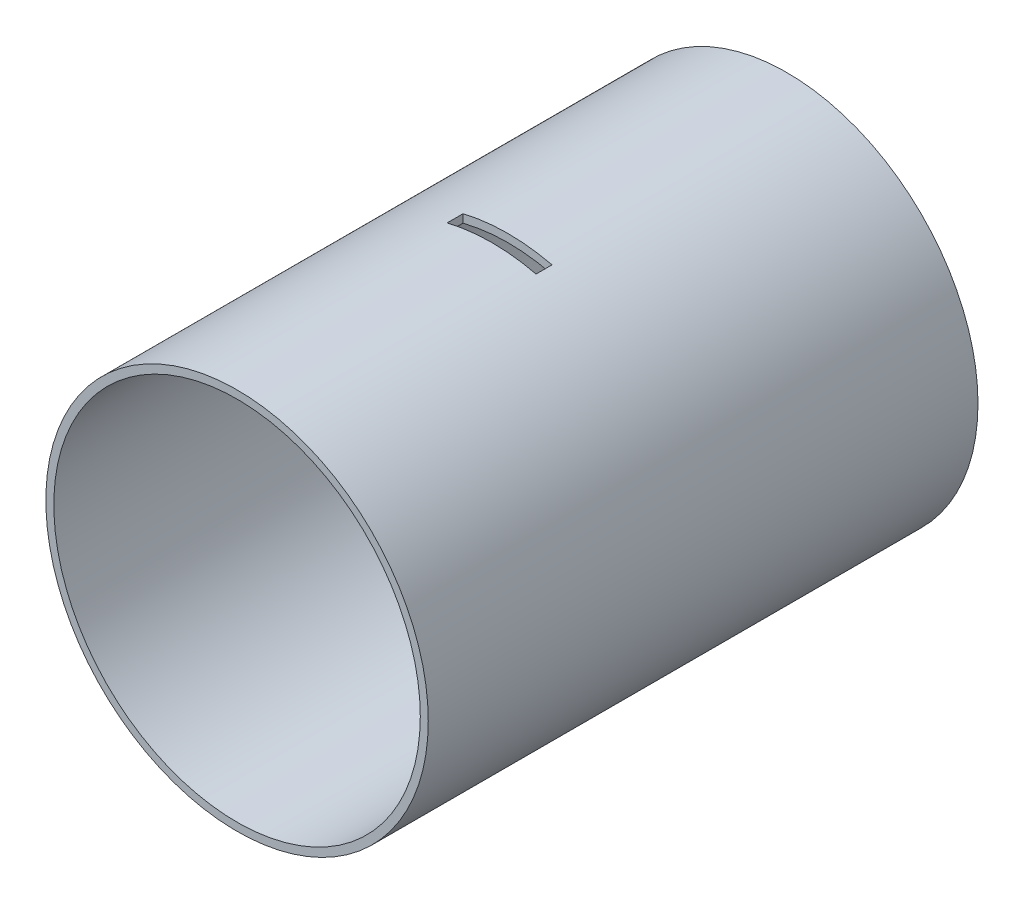
ISO-10303-21;
HEADER;
FILE_DESCRIPTION(('STEP AP214'),'2;1');
FILE_NAME('part.step','',(''),(''),'','','');
FILE_SCHEMA(('AUTOMOTIVE_DESIGN { 1 0 10303 214 1 1 1 1 }'));
ENDSEC;
DATA;
#1=APPLICATION_CONTEXT('core data for automotive mechanical design processes');
#2=APPLICATION_PROTOCOL_DEFINITION('international standard','automotive_design',2000,#1);
#3=PRODUCT_CONTEXT('',#1,'mechanical');
#4=PRODUCT('Part','Part','',(#3));
#5=PRODUCT_RELATED_PRODUCT_CATEGORY('part','',(#4));
#6=PRODUCT_DEFINITION_FORMATION('','',#4);
#7=PRODUCT_DEFINITION_CONTEXT('part definition',#1,'design');
#8=PRODUCT_DEFINITION('design','',#6,#7);
#9=PRODUCT_DEFINITION_SHAPE('','',#8);
#10=(LENGTH_UNIT() NAMED_UNIT(*) SI_UNIT(.MILLI.,.METRE.));
#11=(NAMED_UNIT(*) PLANE_ANGLE_UNIT() SI_UNIT($,.RADIAN.));
#12=(NAMED_UNIT(*) SI_UNIT($,.STERADIAN.) SOLID_ANGLE_UNIT());
#13=UNCERTAINTY_MEASURE_WITH_UNIT(LENGTH_MEASURE(1.E-05),#10,'distance_accuracy_value','');
#14=(GEOMETRIC_REPRESENTATION_CONTEXT(3) GLOBAL_UNCERTAINTY_ASSIGNED_CONTEXT((#13)) GLOBAL_UNIT_ASSIGNED_CONTEXT((#10,
#11,#12)) REPRESENTATION_CONTEXT('',''));
#15=CARTESIAN_POINT('',(0.,0.,0.));
#16=DIRECTION('',(0.,0.,1.));
#17=DIRECTION('',(1.,0.,0.));
#18=AXIS2_PLACEMENT_3D('',#15,#16,#17);
#19=CARTESIAN_POINT('',(0.,0.,438.15));
#20=DIRECTION('',(0.,0.,1.));
#21=DIRECTION('',(1.,0.,0.));
#22=AXIS2_PLACEMENT_3D('',#19,#20,#21);
#23=PLANE('',#22);
#24=CARTESIAN_POINT('',(0.,0.,438.15));
#25=DIRECTION('',(0.,0.,1.));
#26=DIRECTION('',(1.,0.,0.));
#27=AXIS2_PLACEMENT_3D('',#24,#25,#26);
#28=CIRCLE('',#27,152.4);
#29=CARTESIAN_POINT('',(152.4,0.,438.15));
#30=VERTEX_POINT('',#29);
#31=EDGE_CURVE('E187',#30,#30,#28,.T.);
#32=ORIENTED_EDGE('',*,*,#31,.T.);
#33=EDGE_LOOP('',(#32));
#34=FACE_BOUND('',#33,.T.);
#35=CARTESIAN_POINT('',(0.,0.,438.15));
#36=DIRECTION('',(0.,0.,1.));
#37=DIRECTION('',(1.,0.,0.));
#38=AXIS2_PLACEMENT_3D('',#35,#36,#37);
#39=CIRCLE('',#38,146.05);
#40=CARTESIAN_POINT('',(146.05,0.,438.15));
#41=VERTEX_POINT('',#40);
#42=EDGE_CURVE('E180',#41,#41,#39,.T.);
#43=ORIENTED_EDGE('',*,*,#42,.F.);
#44=EDGE_LOOP('',(#43));
#45=FACE_BOUND('',#44,.T.);
#46=ADVANCED_FACE('F37',(#34,#45),#23,.T.);
#47=CARTESIAN_POINT('',(0.,0.,0.));
#48=DIRECTION('',(0.,0.,1.));
#49=DIRECTION('',(1.,0.,0.));
#50=AXIS2_PLACEMENT_3D('',#47,#48,#49);
#51=PLANE('',#50);
#52=CARTESIAN_POINT('',(0.,0.,0.));
#53=DIRECTION('',(0.,0.,1.));
#54=DIRECTION('',(1.,0.,0.));
#55=AXIS2_PLACEMENT_3D('',#52,#53,#54);
#56=CIRCLE('',#55,152.4);
#57=CARTESIAN_POINT('',(152.4,0.,0.));
#58=VERTEX_POINT('',#57);
#59=EDGE_CURVE('E183',#58,#58,#56,.T.);
#60=ORIENTED_EDGE('',*,*,#59,.F.);
#61=EDGE_LOOP('',(#60));
#62=FACE_BOUND('',#61,.T.);
#63=CARTESIAN_POINT('',(0.,0.,0.));
#64=DIRECTION('',(0.,0.,1.));
#65=DIRECTION('',(1.,0.,0.));
#66=AXIS2_PLACEMENT_3D('',#63,#64,#65);
#67=CIRCLE('',#66,146.05);
#68=CARTESIAN_POINT('',(146.05,0.,0.));
#69=VERTEX_POINT('',#68);
#70=EDGE_CURVE('E184',#69,#69,#67,.T.);
#71=ORIENTED_EDGE('',*,*,#70,.T.);
#72=EDGE_LOOP('',(#71));
#73=FACE_BOUND('',#72,.T.);
#74=ADVANCED_FACE('F234',(#62,#73),#51,.F.);
#75=CARTESIAN_POINT('',(0.,0.,438.15));
#76=DIRECTION('',(0.,0.,-1.));
#77=DIRECTION('',(-1.,0.,0.));
#78=AXIS2_PLACEMENT_3D('',#75,#76,#77);
#79=CYLINDRICAL_SURFACE('',#78,152.4);
#80=DIRECTION('',(0.,0.,-1.));
#81=VECTOR('',#80,1.);
#82=CARTESIAN_POINT('',(-151.868936771718,-12.7116499254766,438.15));
#83=LINE('',#82,#81);
#84=CARTESIAN_POINT('',(-151.868936771718,-12.7116499254766,234.95));
#85=VERTEX_POINT('',#84);
#86=CARTESIAN_POINT('',(-151.868936771718,-12.7116499254766,222.25));
#87=VERTEX_POINT('',#86);
#88=EDGE_CURVE('E140',#85,#87,#83,.T.);
#89=ORIENTED_EDGE('',*,*,#88,.T.);
#90=CARTESIAN_POINT('',(0.,0.,222.25));
#91=DIRECTION('',(0.,0.,-1.));
#92=DIRECTION('',(-1.,0.,0.));
#93=AXIS2_PLACEMENT_3D('',#90,#91,#92);
#94=CIRCLE('',#93,152.4);
#95=CARTESIAN_POINT('',(-151.868936771718,12.7116499254766,222.25));
#96=VERTEX_POINT('',#95);
#97=EDGE_CURVE('E133',#87,#96,#94,.T.);
#98=ORIENTED_EDGE('',*,*,#97,.T.);
#99=DIRECTION('',(0.,0.,-1.));
#100=VECTOR('',#99,1.);
#101=CARTESIAN_POINT('',(-151.868936771718,12.7116499254766,438.15));
#102=LINE('',#101,#100);
#103=CARTESIAN_POINT('',(-151.868936771718,12.7116499254766,234.95));
#104=VERTEX_POINT('',#103);
#105=EDGE_CURVE('E122',#96,#104,#102,.F.);
#106=ORIENTED_EDGE('',*,*,#105,.T.);
#107=CARTESIAN_POINT('',(0.,0.,234.95));
#108=DIRECTION('',(0.,0.,1.));
#109=DIRECTION('',(1.,0.,0.));
#110=AXIS2_PLACEMENT_3D('',#107,#108,#109);
#111=CIRCLE('',#110,152.4);
#112=EDGE_CURVE('E127',#104,#85,#111,.T.);
#113=ORIENTED_EDGE('',*,*,#112,.T.);
#114=EDGE_LOOP('',(#89,#98,#106,#113));
#115=FACE_BOUND('',#114,.T.);
#116=DIRECTION('',(0.,0.,-1.));
#117=VECTOR('',#116,1.);
#118=CARTESIAN_POINT('',(-35.779138521729,-148.140518585034,438.15));
#119=LINE('',#118,#117);
#120=CARTESIAN_POINT('',(-35.779138521729,-148.140518585034,222.25));
#121=VERTEX_POINT('',#120);
#122=CARTESIAN_POINT('',(-35.779138521729,-148.140518585035,234.95));
#123=VERTEX_POINT('',#122);
#124=EDGE_CURVE('E170',#121,#123,#119,.F.);
#125=ORIENTED_EDGE('',*,*,#124,.T.);
#126=CARTESIAN_POINT('',(0.,0.,234.95));
#127=DIRECTION('',(0.,0.,1.));
#128=DIRECTION('',(1.,0.,0.));
#129=AXIS2_PLACEMENT_3D('',#126,#127,#128);
#130=CIRCLE('',#129,152.4);
#131=CARTESIAN_POINT('',(35.1399245109825,-148.293444579868,234.95));
#132=VERTEX_POINT('',#131);
#133=EDGE_CURVE('E176',#123,#132,#130,.T.);
#134=ORIENTED_EDGE('',*,*,#133,.T.);
#135=DIRECTION('',(0.,0.,-1.));
#136=VECTOR('',#135,1.);
#137=CARTESIAN_POINT('',(35.1399245109825,-148.293444579868,438.15));
#138=LINE('',#137,#136);
#139=CARTESIAN_POINT('',(35.1399245109825,-148.293444579868,222.25));
#140=VERTEX_POINT('',#139);
#141=EDGE_CURVE('E163',#132,#140,#138,.T.);
#142=ORIENTED_EDGE('',*,*,#141,.T.);
#143=CARTESIAN_POINT('',(0.,0.,222.25));
#144=DIRECTION('',(0.,0.,1.));
#145=DIRECTION('',(1.,0.,0.));
#146=AXIS2_PLACEMENT_3D('',#143,#144,#145);
#147=CIRCLE('',#146,152.4);
#148=EDGE_CURVE('E166',#121,#140,#147,.T.);
#149=ORIENTED_EDGE('',*,*,#148,.F.);
#150=EDGE_LOOP('',(#125,#134,#142,#149));
#151=FACE_BOUND('',#150,.T.);
#152=DIRECTION('',(0.,0.,-1.));
#153=VECTOR('',#152,1.);
#154=CARTESIAN_POINT('',(35.1399245109825,148.293444579868,438.15));
#155=LINE('',#154,#153);
#156=CARTESIAN_POINT('',(35.1399245109825,148.293444579868,222.25));
#157=VERTEX_POINT('',#156);
#158=CARTESIAN_POINT('',(35.1399245109825,148.293444579868,234.95));
#159=VERTEX_POINT('',#158);
#160=EDGE_CURVE('E160',#157,#159,#155,.F.);
#161=ORIENTED_EDGE('',*,*,#160,.T.);
#162=CARTESIAN_POINT('',(-35.779138521729,148.140518585034,234.95));
#163=VERTEX_POINT('',#162);
#164=EDGE_CURVE('E179',#159,#163,#130,.T.);
#165=ORIENTED_EDGE('',*,*,#164,.T.);
#166=DIRECTION('',(0.,0.,-1.));
#167=VECTOR('',#166,1.);
#168=CARTESIAN_POINT('',(-35.779138521729,148.140518585034,438.15));
#169=LINE('',#168,#167);
#170=CARTESIAN_POINT('',(-35.779138521729,148.140518585034,222.25));
#171=VERTEX_POINT('',#170);
#172=EDGE_CURVE('E173',#163,#171,#169,.T.);
#173=ORIENTED_EDGE('',*,*,#172,.T.);
#174=EDGE_CURVE('E169',#157,#171,#147,.T.);
#175=ORIENTED_EDGE('',*,*,#174,.F.);
#176=EDGE_LOOP('',(#161,#165,#173,#175));
#177=FACE_BOUND('',#176,.T.);
#178=ORIENTED_EDGE('',*,*,#31,.F.);
#179=EDGE_LOOP('',(#178));
#180=FACE_BOUND('',#179,.T.);
#181=ORIENTED_EDGE('',*,*,#59,.T.);
#182=EDGE_LOOP('',(#181));
#183=FACE_BOUND('',#182,.T.);
#184=ADVANCED_FACE('F39',(#115,#151,#177,#180,#183),#79,.T.);
#185=CARTESIAN_POINT('',(0.,0.,438.15));
#186=DIRECTION('',(0.,0.,-1.));
#187=DIRECTION('',(-1.,0.,0.));
#188=AXIS2_PLACEMENT_3D('',#185,#186,#187);
#189=CYLINDRICAL_SURFACE('',#188,146.05);
#190=CARTESIAN_POINT('',(0.,0.,222.25));
#191=DIRECTION('',(0.,0.,-1.));
#192=DIRECTION('',(-1.,0.,0.));
#193=AXIS2_PLACEMENT_3D('',#190,#191,#192);
#194=CIRCLE('',#193,146.05);
#195=CARTESIAN_POINT('',(-145.495760956023,-12.7116499254766,222.25));
#196=VERTEX_POINT('',#195);
#197=CARTESIAN_POINT('',(-145.495760956023,12.7116499254766,222.25));
#198=VERTEX_POINT('',#197);
#199=EDGE_CURVE('E11',#196,#198,#194,.T.);
#200=ORIENTED_EDGE('',*,*,#199,.F.);
#201=DIRECTION('',(0.,0.,-1.));
#202=VECTOR('',#201,1.);
#203=CARTESIAN_POINT('',(-145.495760956023,-12.7116499254766,438.15));
#204=LINE('',#203,#202);
#205=CARTESIAN_POINT('',(-145.495760956023,-12.7116499254766,234.95));
#206=VERTEX_POINT('',#205);
#207=EDGE_CURVE('E45',#206,#196,#204,.T.);
#208=ORIENTED_EDGE('',*,*,#207,.F.);
#209=CARTESIAN_POINT('',(0.,0.,234.95));
#210=DIRECTION('',(0.,0.,1.));
#211=DIRECTION('',(1.,0.,0.));
#212=AXIS2_PLACEMENT_3D('',#209,#210,#211);
#213=CIRCLE('',#212,146.05);
#214=CARTESIAN_POINT('',(-145.495760956023,12.7116499254766,234.95));
#215=VERTEX_POINT('',#214);
#216=EDGE_CURVE('E209',#215,#206,#213,.T.);
#217=ORIENTED_EDGE('',*,*,#216,.F.);
#218=DIRECTION('',(0.,0.,-1.));
#219=VECTOR('',#218,1.);
#220=CARTESIAN_POINT('',(-145.495760956023,12.7116499254766,438.15));
#221=LINE('',#220,#219);
#222=EDGE_CURVE('E207',#198,#215,#221,.F.);
#223=ORIENTED_EDGE('',*,*,#222,.F.);
#224=EDGE_LOOP('',(#200,#208,#217,#223));
#225=FACE_BOUND('',#224,.T.);
#226=CARTESIAN_POINT('',(0.,0.,234.95));
#227=DIRECTION('',(0.,0.,1.));
#228=DIRECTION('',(1.,0.,0.));
#229=AXIS2_PLACEMENT_3D('',#226,#227,#228);
#230=CIRCLE('',#229,146.05);
#231=CARTESIAN_POINT('',(-35.779138521729,-141.599631873261,234.95));
#232=VERTEX_POINT('',#231);
#233=CARTESIAN_POINT('',(35.1399245109825,-141.759614154958,234.95));
#234=VERTEX_POINT('',#233);
#235=EDGE_CURVE('E203',#232,#234,#230,.T.);
#236=ORIENTED_EDGE('',*,*,#235,.F.);
#237=DIRECTION('',(0.,0.,-1.));
#238=VECTOR('',#237,1.);
#239=CARTESIAN_POINT('',(-35.779138521729,-141.599631873261,438.15));
#240=LINE('',#239,#238);
#241=CARTESIAN_POINT('',(-35.779138521729,-141.599631873261,222.25));
#242=VERTEX_POINT('',#241);
#243=EDGE_CURVE('E205',#242,#232,#240,.F.);
#244=ORIENTED_EDGE('',*,*,#243,.F.);
#245=CARTESIAN_POINT('',(0.,0.,222.25));
#246=DIRECTION('',(0.,0.,1.));
#247=DIRECTION('',(1.,0.,0.));
#248=AXIS2_PLACEMENT_3D('',#245,#246,#247);
#249=CIRCLE('',#248,146.05);
#250=CARTESIAN_POINT('',(35.1399245109825,-141.759614154958,222.25));
#251=VERTEX_POINT('',#250);
#252=EDGE_CURVE('E198',#242,#251,#249,.T.);
#253=ORIENTED_EDGE('',*,*,#252,.T.);
#254=DIRECTION('',(0.,0.,-1.));
#255=VECTOR('',#254,1.);
#256=CARTESIAN_POINT('',(35.1399245109825,-141.759614154958,438.15));
#257=LINE('',#256,#255);
#258=EDGE_CURVE('E202',#234,#251,#257,.T.);
#259=ORIENTED_EDGE('',*,*,#258,.F.);
#260=EDGE_LOOP('',(#236,#244,#253,#259));
#261=FACE_BOUND('',#260,.T.);
#262=CARTESIAN_POINT('',(35.1399245109825,141.759614154957,234.95));
#263=VERTEX_POINT('',#262);
#264=CARTESIAN_POINT('',(-35.779138521729,141.59963187326,234.95));
#265=VERTEX_POINT('',#264);
#266=EDGE_CURVE('E200',#263,#265,#230,.T.);
#267=ORIENTED_EDGE('',*,*,#266,.F.);
#268=DIRECTION('',(0.,0.,-1.));
#269=VECTOR('',#268,1.);
#270=CARTESIAN_POINT('',(35.1399245109825,141.759614154958,438.15));
#271=LINE('',#270,#269);
#272=CARTESIAN_POINT('',(35.1399245109825,141.759614154958,222.25));
#273=VERTEX_POINT('',#272);
#274=EDGE_CURVE('E190',#273,#263,#271,.F.);
#275=ORIENTED_EDGE('',*,*,#274,.F.);
#276=CARTESIAN_POINT('',(-35.779138521729,141.599631873261,222.25));
#277=VERTEX_POINT('',#276);
#278=EDGE_CURVE('E194',#273,#277,#249,.T.);
#279=ORIENTED_EDGE('',*,*,#278,.T.);
#280=DIRECTION('',(0.,0.,-1.));
#281=VECTOR('',#280,1.);
#282=CARTESIAN_POINT('',(-35.779138521729,141.599631873261,438.15));
#283=LINE('',#282,#281);
#284=EDGE_CURVE('E197',#265,#277,#283,.T.);
#285=ORIENTED_EDGE('',*,*,#284,.F.);
#286=EDGE_LOOP('',(#267,#275,#279,#285));
#287=FACE_BOUND('',#286,.T.);
#288=ORIENTED_EDGE('',*,*,#42,.T.);
#289=EDGE_LOOP('',(#288));
#290=FACE_BOUND('',#289,.T.);
#291=ORIENTED_EDGE('',*,*,#70,.F.);
#292=EDGE_LOOP('',(#291));
#293=FACE_BOUND('',#292,.T.);
#294=ADVANCED_FACE('F219',(#225,#261,#287,#290,#293),#189,.F.);
#295=CARTESIAN_POINT('',(35.1399245109825,-400.05,0.));
#296=DIRECTION('',(1.,0.,0.));
#297=DIRECTION('',(0.,0.,-1.));
#298=AXIS2_PLACEMENT_3D('',#295,#296,#297);
#299=PLANE('',#298);
#300=DIRECTION('',(0.,1.,0.));
#301=VECTOR('',#300,1.);
#302=CARTESIAN_POINT('',(35.1399245109825,-400.05,222.25));
#303=LINE('',#302,#301);
#304=EDGE_CURVE('E157',#273,#157,#303,.T.);
#305=ORIENTED_EDGE('',*,*,#304,.F.);
#306=ORIENTED_EDGE('',*,*,#274,.T.);
#307=DIRECTION('',(0.,1.,0.));
#308=VECTOR('',#307,1.);
#309=CARTESIAN_POINT('',(35.1399245109825,-400.05,234.95));
#310=LINE('',#309,#308);
#311=EDGE_CURVE('E141',#263,#159,#310,.T.);
#312=ORIENTED_EDGE('',*,*,#311,.T.);
#313=ORIENTED_EDGE('',*,*,#160,.F.);
#314=EDGE_LOOP('',(#305,#306,#312,#313));
#315=FACE_BOUND('',#314,.T.);
#316=ADVANCED_FACE('F245',(#315),#299,.F.);
#317=CARTESIAN_POINT('',(0.,-400.05,222.25));
#318=DIRECTION('',(0.,0.,1.));
#319=DIRECTION('',(1.,0.,0.));
#320=AXIS2_PLACEMENT_3D('',#317,#318,#319);
#321=PLANE('',#320);
#322=ORIENTED_EDGE('',*,*,#174,.T.);
#323=DIRECTION('',(0.,1.,0.));
#324=VECTOR('',#323,1.);
#325=CARTESIAN_POINT('',(-35.779138521729,-400.05,222.25));
#326=LINE('',#325,#324);
#327=EDGE_CURVE('E153',#277,#171,#326,.T.);
#328=ORIENTED_EDGE('',*,*,#327,.F.);
#329=ORIENTED_EDGE('',*,*,#278,.F.);
#330=ORIENTED_EDGE('',*,*,#304,.T.);
#331=EDGE_LOOP('',(#322,#328,#329,#330));
#332=FACE_BOUND('',#331,.T.);
#333=ADVANCED_FACE('F257',(#332),#321,.T.);
#334=CARTESIAN_POINT('',(-35.779138521729,-400.05,0.));
#335=DIRECTION('',(-1.,0.,0.));
#336=DIRECTION('',(0.,0.,1.));
#337=AXIS2_PLACEMENT_3D('',#334,#335,#336);
#338=PLANE('',#337);
#339=DIRECTION('',(0.,1.,0.));
#340=VECTOR('',#339,1.);
#341=CARTESIAN_POINT('',(-35.779138521729,-400.05,234.95));
#342=LINE('',#341,#340);
#343=EDGE_CURVE('E148',#265,#163,#342,.T.);
#344=ORIENTED_EDGE('',*,*,#343,.F.);
#345=ORIENTED_EDGE('',*,*,#284,.T.);
#346=ORIENTED_EDGE('',*,*,#327,.T.);
#347=ORIENTED_EDGE('',*,*,#172,.F.);
#348=EDGE_LOOP('',(#344,#345,#346,#347));
#349=FACE_BOUND('',#348,.T.);
#350=ADVANCED_FACE('F250',(#349),#338,.F.);
#351=CARTESIAN_POINT('',(0.,-400.05,234.95));
#352=DIRECTION('',(0.,0.,1.));
#353=DIRECTION('',(1.,0.,0.));
#354=AXIS2_PLACEMENT_3D('',#351,#352,#353);
#355=PLANE('',#354);
#356=ORIENTED_EDGE('',*,*,#311,.F.);
#357=ORIENTED_EDGE('',*,*,#266,.T.);
#358=ORIENTED_EDGE('',*,*,#343,.T.);
#359=ORIENTED_EDGE('',*,*,#164,.F.);
#360=EDGE_LOOP('',(#356,#357,#358,#359));
#361=FACE_BOUND('',#360,.T.);
#362=ADVANCED_FACE('F246',(#361),#355,.F.);
#363=EDGE_CURVE('E151',#123,#232,#342,.T.);
#364=ORIENTED_EDGE('',*,*,#363,.T.);
#365=ORIENTED_EDGE('',*,*,#235,.T.);
#366=EDGE_CURVE('E143',#132,#234,#310,.T.);
#367=ORIENTED_EDGE('',*,*,#366,.F.);
#368=ORIENTED_EDGE('',*,*,#133,.F.);
#369=EDGE_LOOP('',(#364,#365,#367,#368));
#370=FACE_BOUND('',#369,.T.);
#371=ADVANCED_FACE('F249',(#370),#355,.F.);
#372=EDGE_CURVE('E152',#121,#242,#326,.T.);
#373=ORIENTED_EDGE('',*,*,#372,.T.);
#374=ORIENTED_EDGE('',*,*,#243,.T.);
#375=ORIENTED_EDGE('',*,*,#363,.F.);
#376=ORIENTED_EDGE('',*,*,#124,.F.);
#377=EDGE_LOOP('',(#373,#374,#375,#376));
#378=FACE_BOUND('',#377,.T.);
#379=ADVANCED_FACE('F264',(#378),#338,.F.);
#380=ORIENTED_EDGE('',*,*,#148,.T.);
#381=EDGE_CURVE('E156',#140,#251,#303,.T.);
#382=ORIENTED_EDGE('',*,*,#381,.T.);
#383=ORIENTED_EDGE('',*,*,#252,.F.);
#384=ORIENTED_EDGE('',*,*,#372,.F.);
#385=EDGE_LOOP('',(#380,#382,#383,#384));
#386=FACE_BOUND('',#385,.T.);
#387=ADVANCED_FACE('F255',(#386),#321,.T.);
#388=ORIENTED_EDGE('',*,*,#366,.T.);
#389=ORIENTED_EDGE('',*,*,#258,.T.);
#390=ORIENTED_EDGE('',*,*,#381,.F.);
#391=ORIENTED_EDGE('',*,*,#141,.F.);
#392=EDGE_LOOP('',(#388,#389,#390,#391));
#393=FACE_BOUND('',#392,.T.);
#394=ADVANCED_FACE('F252',(#393),#299,.F.);
#395=CARTESIAN_POINT('',(-508.,12.7116499254766,222.25));
#396=DIRECTION('',(0.,0.,-1.));
#397=DIRECTION('',(-1.,0.,0.));
#398=AXIS2_PLACEMENT_3D('',#395,#396,#397);
#399=PLANE('',#398);
#400=DIRECTION('',(1.,0.,0.));
#401=VECTOR('',#400,1.);
#402=CARTESIAN_POINT('',(-508.,-12.7116499254766,222.25));
#403=LINE('',#402,#401);
#404=EDGE_CURVE('E128',#87,#196,#403,.T.);
#405=ORIENTED_EDGE('',*,*,#404,.T.);
#406=ORIENTED_EDGE('',*,*,#199,.T.);
#407=DIRECTION('',(1.,0.,0.));
#408=VECTOR('',#407,1.);
#409=CARTESIAN_POINT('',(-508.,12.7116499254766,222.25));
#410=LINE('',#409,#408);
#411=EDGE_CURVE('E57',#96,#198,#410,.T.);
#412=ORIENTED_EDGE('',*,*,#411,.F.);
#413=ORIENTED_EDGE('',*,*,#97,.F.);
#414=EDGE_LOOP('',(#405,#406,#412,#413));
#415=FACE_BOUND('',#414,.T.);
#416=ADVANCED_FACE('F132',(#415),#399,.F.);
#417=CARTESIAN_POINT('',(-508.,-12.7116499254766,222.25));
#418=DIRECTION('',(0.,-1.,0.));
#419=DIRECTION('',(0.,0.,-1.));
#420=AXIS2_PLACEMENT_3D('',#417,#418,#419);
#421=PLANE('',#420);
#422=DIRECTION('',(1.,0.,0.));
#423=VECTOR('',#422,1.);
#424=CARTESIAN_POINT('',(-508.,-12.7116499254766,234.95));
#425=LINE('',#424,#423);
#426=EDGE_CURVE('E215',#85,#206,#425,.T.);
#427=ORIENTED_EDGE('',*,*,#426,.T.);
#428=ORIENTED_EDGE('',*,*,#207,.T.);
#429=ORIENTED_EDGE('',*,*,#404,.F.);
#430=ORIENTED_EDGE('',*,*,#88,.F.);
#431=EDGE_LOOP('',(#427,#428,#429,#430));
#432=FACE_BOUND('',#431,.T.);
#433=ADVANCED_FACE('F213',(#432),#421,.F.);
#434=CARTESIAN_POINT('',(-508.,-12.7116499254766,234.95));
#435=DIRECTION('',(0.,0.,1.));
#436=DIRECTION('',(1.,0.,0.));
#437=AXIS2_PLACEMENT_3D('',#434,#435,#436);
#438=PLANE('',#437);
#439=DIRECTION('',(1.,0.,0.));
#440=VECTOR('',#439,1.);
#441=CARTESIAN_POINT('',(-508.,12.7116499254766,234.95));
#442=LINE('',#441,#440);
#443=EDGE_CURVE('E52',#104,#215,#442,.T.);
#444=ORIENTED_EDGE('',*,*,#443,.T.);
#445=ORIENTED_EDGE('',*,*,#216,.T.);
#446=ORIENTED_EDGE('',*,*,#426,.F.);
#447=ORIENTED_EDGE('',*,*,#112,.F.);
#448=EDGE_LOOP('',(#444,#445,#446,#447));
#449=FACE_BOUND('',#448,.T.);
#450=ADVANCED_FACE('F222',(#449),#438,.F.);
#451=CARTESIAN_POINT('',(-508.,12.7116499254766,234.95));
#452=DIRECTION('',(0.,1.,0.));
#453=DIRECTION('',(0.,0.,1.));
#454=AXIS2_PLACEMENT_3D('',#451,#452,#453);
#455=PLANE('',#454);
#456=ORIENTED_EDGE('',*,*,#411,.T.);
#457=ORIENTED_EDGE('',*,*,#222,.T.);
#458=ORIENTED_EDGE('',*,*,#443,.F.);
#459=ORIENTED_EDGE('',*,*,#105,.F.);
#460=EDGE_LOOP('',(#456,#457,#458,#459));
#461=FACE_BOUND('',#460,.T.);
#462=ADVANCED_FACE('F123',(#461),#455,.F.);
#463=CLOSED_SHELL('',(#46,#74,#184,#294,#316,#333,#350,#362,#371,#379,#387,#394,#416,#433,#450,#462));
#464=MANIFOLD_SOLID_BREP('B2',#463);
#465=ADVANCED_BREP_SHAPE_REPRESENTATION('',(#18,#464),#14);
#466=SHAPE_DEFINITION_REPRESENTATION(#9,#465);
ENDSEC;
END-ISO-10303-21;
